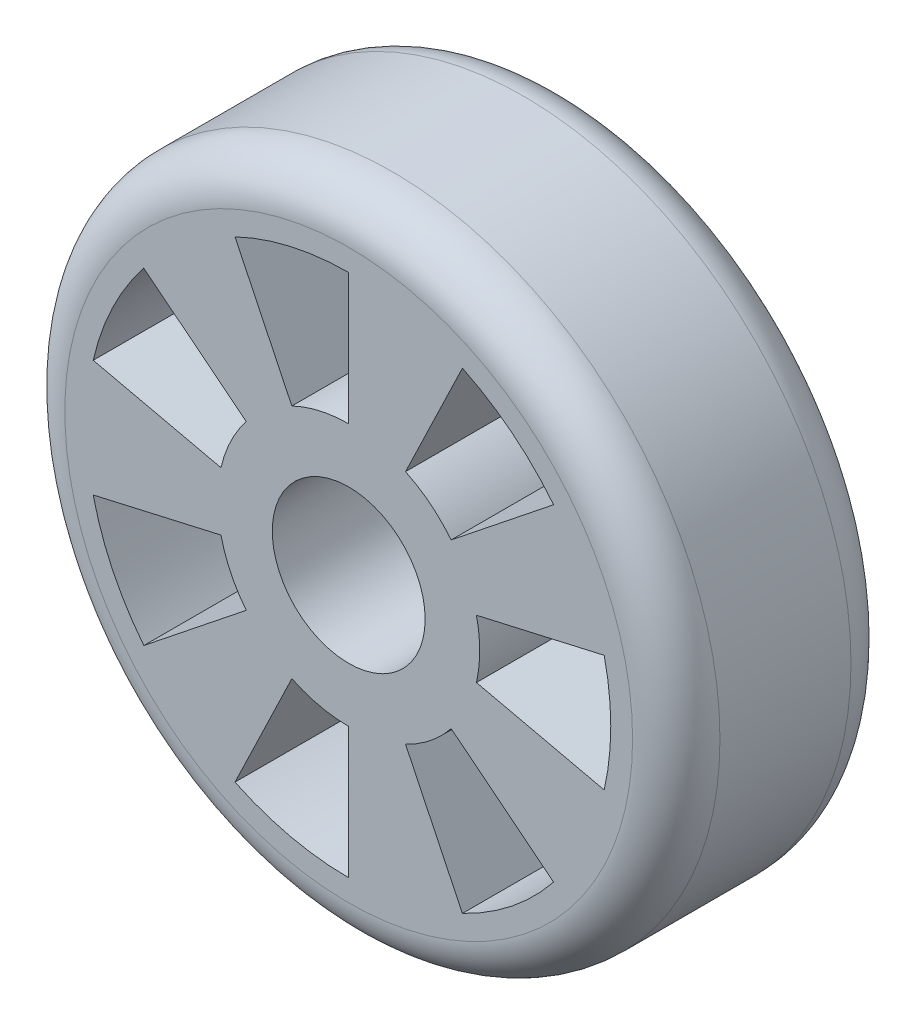
ISO-10303-21;
HEADER;
FILE_DESCRIPTION(('STEP AP214'),'2;1');
FILE_NAME('part.step','',(''),(''),'','','');
FILE_SCHEMA(('AUTOMOTIVE_DESIGN { 1 0 10303 214 1 1 1 1 }'));
ENDSEC;
DATA;
#1=APPLICATION_CONTEXT('core data for automotive mechanical design processes');
#2=APPLICATION_PROTOCOL_DEFINITION('international standard','automotive_design',2000,#1);
#3=PRODUCT_CONTEXT('',#1,'mechanical');
#4=PRODUCT('Part','Part','',(#3));
#5=PRODUCT_RELATED_PRODUCT_CATEGORY('part','',(#4));
#6=PRODUCT_DEFINITION_FORMATION('','',#4);
#7=PRODUCT_DEFINITION_CONTEXT('part definition',#1,'design');
#8=PRODUCT_DEFINITION('design','',#6,#7);
#9=PRODUCT_DEFINITION_SHAPE('','',#8);
#10=(LENGTH_UNIT() NAMED_UNIT(*) SI_UNIT(.MILLI.,.METRE.));
#11=(NAMED_UNIT(*) PLANE_ANGLE_UNIT() SI_UNIT($,.RADIAN.));
#12=(NAMED_UNIT(*) SI_UNIT($,.STERADIAN.) SOLID_ANGLE_UNIT());
#13=UNCERTAINTY_MEASURE_WITH_UNIT(LENGTH_MEASURE(1.E-05),#10,'distance_accuracy_value','');
#14=(GEOMETRIC_REPRESENTATION_CONTEXT(3) GLOBAL_UNCERTAINTY_ASSIGNED_CONTEXT((#13)) GLOBAL_UNIT_ASSIGNED_CONTEXT((#10,
#11,#12)) REPRESENTATION_CONTEXT('',''));
#15=CARTESIAN_POINT('',(0.,0.,0.));
#16=DIRECTION('',(0.,0.,1.));
#17=DIRECTION('',(1.,0.,0.));
#18=AXIS2_PLACEMENT_3D('',#15,#16,#17);
#19=CARTESIAN_POINT('',(0.,0.,-50.));
#20=DIRECTION('',(0.,0.,1.));
#21=DIRECTION('',(1.,0.,0.));
#22=AXIS2_PLACEMENT_3D('',#19,#20,#21);
#23=CYLINDRICAL_SURFACE('',#22,75.);
#24=CARTESIAN_POINT('',(0.,0.,-10.));
#25=DIRECTION('',(0.,0.,1.));
#26=DIRECTION('',(1.,0.,0.));
#27=AXIS2_PLACEMENT_3D('',#24,#25,#26);
#28=CIRCLE('',#27,75.);
#29=CARTESIAN_POINT('',(75.,0.,-10.));
#30=VERTEX_POINT('',#29);
#31=EDGE_CURVE('E47',#30,#30,#28,.F.);
#32=ORIENTED_EDGE('',*,*,#31,.T.);
#33=EDGE_LOOP('',(#32));
#34=FACE_BOUND('',#33,.T.);
#35=CARTESIAN_POINT('',(0.,0.,-40.));
#36=DIRECTION('',(0.,0.,1.));
#37=DIRECTION('',(1.,0.,0.));
#38=AXIS2_PLACEMENT_3D('',#35,#36,#37);
#39=CIRCLE('',#38,75.);
#40=CARTESIAN_POINT('',(75.,0.,-40.));
#41=VERTEX_POINT('',#40);
#42=EDGE_CURVE('E459',#41,#41,#39,.T.);
#43=ORIENTED_EDGE('',*,*,#42,.T.);
#44=EDGE_LOOP('',(#43));
#45=FACE_BOUND('',#44,.T.);
#46=ADVANCED_FACE('F39',(#34,#45),#23,.T.);
#47=CARTESIAN_POINT('',(0.,0.,-50.));
#48=DIRECTION('',(0.,0.,1.));
#49=DIRECTION('',(1.,0.,0.));
#50=AXIS2_PLACEMENT_3D('',#47,#48,#49);
#51=PLANE('',#50);
#52=CARTESIAN_POINT('',(0.,0.,-50.));
#53=DIRECTION('',(0.,0.,1.));
#54=DIRECTION('',(1.,0.,0.));
#55=AXIS2_PLACEMENT_3D('',#52,#53,#54);
#56=CIRCLE('',#55,17.5);
#57=CARTESIAN_POINT('',(17.5,0.,-50.));
#58=VERTEX_POINT('',#57);
#59=EDGE_CURVE('E255',#58,#58,#56,.T.);
#60=ORIENTED_EDGE('',*,*,#59,.T.);
#61=EDGE_LOOP('',(#60));
#62=FACE_BOUND('',#61,.T.);
#63=CARTESIAN_POINT('',(0.,0.,-50.));
#64=DIRECTION('',(0.,0.,1.));
#65=DIRECTION('',(1.,0.,0.));
#66=AXIS2_PLACEMENT_3D('',#63,#64,#65);
#67=CIRCLE('',#66,65.);
#68=CARTESIAN_POINT('',(65.,0.,-50.));
#69=VERTEX_POINT('',#68);
#70=EDGE_CURVE('E11',#69,#69,#67,.F.);
#71=ORIENTED_EDGE('',*,*,#70,.T.);
#72=EDGE_LOOP('',(#71));
#73=FACE_BOUND('',#72,.T.);
#74=DIRECTION('',(0.974927912181824,-0.222520933956314,0.));
#75=VECTOR('',#74,1.);
#76=CARTESIAN_POINT('',(-29.2478373654547,6.67562801868943,-50.));
#77=LINE('',#76,#75);
#78=CARTESIAN_POINT('',(-58.4956747309094,13.3512560373788,-50.));
#79=VERTEX_POINT('',#78);
#80=CARTESIAN_POINT('',(-29.2478373654547,6.67562801868943,-50.));
#81=VERTEX_POINT('',#80);
#82=EDGE_CURVE('E232',#79,#81,#77,.T.);
#83=ORIENTED_EDGE('',*,*,#82,.T.);
#84=CARTESIAN_POINT('',(0.,0.,-50.));
#85=DIRECTION('',(0.,0.,-1.));
#86=DIRECTION('',(1.,0.,0.));
#87=AXIS2_PLACEMENT_3D('',#84,#85,#86);
#88=CIRCLE('',#87,30.);
#89=CARTESIAN_POINT('',(-23.4549444740409,18.704694055762,-50.));
#90=VERTEX_POINT('',#89);
#91=EDGE_CURVE('E226',#81,#90,#88,.T.);
#92=ORIENTED_EDGE('',*,*,#91,.T.);
#93=DIRECTION('',(-0.78183148246803,0.623489801858733,0.));
#94=VECTOR('',#93,1.);
#95=CARTESIAN_POINT('',(-23.4549444740409,18.704694055762,-50.));
#96=LINE('',#95,#94);
#97=CARTESIAN_POINT('',(-46.9098889480818,37.409388111524,-50.));
#98=VERTEX_POINT('',#97);
#99=EDGE_CURVE('E235',#90,#98,#96,.T.);
#100=ORIENTED_EDGE('',*,*,#99,.T.);
#101=CARTESIAN_POINT('',(0.,0.,-50.));
#102=DIRECTION('',(0.,0.,1.));
#103=DIRECTION('',(1.,0.,0.));
#104=AXIS2_PLACEMENT_3D('',#101,#102,#103);
#105=CIRCLE('',#104,60.);
#106=EDGE_CURVE('E54',#98,#79,#105,.T.);
#107=ORIENTED_EDGE('',*,*,#106,.T.);
#108=EDGE_LOOP('',(#83,#92,#100,#107));
#109=FACE_BOUND('',#108,.T.);
#110=DIRECTION('',(0.78183148246803,0.623489801858734,0.));
#111=VECTOR('',#110,1.);
#112=CARTESIAN_POINT('',(-23.4549444740409,-18.704694055762,-50.));
#113=LINE('',#112,#111);
#114=CARTESIAN_POINT('',(-46.9098889480818,-37.409388111524,-50.));
#115=VERTEX_POINT('',#114);
#116=CARTESIAN_POINT('',(-23.4549444740409,-18.704694055762,-50.));
#117=VERTEX_POINT('',#116);
#118=EDGE_CURVE('E275',#115,#117,#113,.T.);
#119=ORIENTED_EDGE('',*,*,#118,.T.);
#120=CARTESIAN_POINT('',(0.,0.,-50.));
#121=DIRECTION('',(0.,0.,-1.));
#122=DIRECTION('',(1.,0.,0.));
#123=AXIS2_PLACEMENT_3D('',#120,#121,#122);
#124=CIRCLE('',#123,30.);
#125=CARTESIAN_POINT('',(-29.2478373654547,-6.67562801868943,-50.));
#126=VERTEX_POINT('',#125);
#127=EDGE_CURVE('E265',#117,#126,#124,.T.);
#128=ORIENTED_EDGE('',*,*,#127,.T.);
#129=DIRECTION('',(-0.974927912181824,-0.222520933956315,0.));
#130=VECTOR('',#129,1.);
#131=CARTESIAN_POINT('',(-29.2478373654547,-6.67562801868943,-50.));
#132=LINE('',#131,#130);
#133=CARTESIAN_POINT('',(-58.4956747309094,-13.3512560373789,-50.));
#134=VERTEX_POINT('',#133);
#135=EDGE_CURVE('E268',#126,#134,#132,.T.);
#136=ORIENTED_EDGE('',*,*,#135,.T.);
#137=CARTESIAN_POINT('',(0.,0.,-50.));
#138=DIRECTION('',(0.,0.,1.));
#139=DIRECTION('',(1.,0.,0.));
#140=AXIS2_PLACEMENT_3D('',#137,#138,#139);
#141=CIRCLE('',#140,60.);
#142=EDGE_CURVE('E272',#134,#115,#141,.T.);
#143=ORIENTED_EDGE('',*,*,#142,.T.);
#144=EDGE_LOOP('',(#119,#128,#136,#143));
#145=FACE_BOUND('',#144,.T.);
#146=DIRECTION('',(0.,1.,0.));
#147=VECTOR('',#146,1.);
#148=CARTESIAN_POINT('',(0.,-30.,-50.));
#149=LINE('',#148,#147);
#150=CARTESIAN_POINT('',(0.,-60.,-50.));
#151=VERTEX_POINT('',#150);
#152=CARTESIAN_POINT('',(0.,-30.,-50.));
#153=VERTEX_POINT('',#152);
#154=EDGE_CURVE('E307',#151,#153,#149,.T.);
#155=ORIENTED_EDGE('',*,*,#154,.T.);
#156=CARTESIAN_POINT('',(0.,0.,-50.));
#157=DIRECTION('',(0.,0.,-1.));
#158=DIRECTION('',(1.,0.,0.));
#159=AXIS2_PLACEMENT_3D('',#156,#157,#158);
#160=CIRCLE('',#159,30.);
#161=CARTESIAN_POINT('',(-13.0165121735267,-27.0290660370726,-50.));
#162=VERTEX_POINT('',#161);
#163=EDGE_CURVE('E297',#153,#162,#160,.T.);
#164=ORIENTED_EDGE('',*,*,#163,.T.);
#165=DIRECTION('',(-0.433883739117558,-0.900968867902419,0.));
#166=VECTOR('',#165,1.);
#167=CARTESIAN_POINT('',(-13.0165121735267,-27.0290660370726,-50.));
#168=LINE('',#167,#166);
#169=CARTESIAN_POINT('',(-26.0330243470535,-54.0581320741451,-50.));
#170=VERTEX_POINT('',#169);
#171=EDGE_CURVE('E300',#162,#170,#168,.T.);
#172=ORIENTED_EDGE('',*,*,#171,.T.);
#173=CARTESIAN_POINT('',(0.,0.,-50.));
#174=DIRECTION('',(0.,0.,1.));
#175=DIRECTION('',(1.,0.,0.));
#176=AXIS2_PLACEMENT_3D('',#173,#174,#175);
#177=CIRCLE('',#176,60.);
#178=EDGE_CURVE('E304',#170,#151,#177,.T.);
#179=ORIENTED_EDGE('',*,*,#178,.T.);
#180=EDGE_LOOP('',(#155,#164,#172,#179));
#181=FACE_BOUND('',#180,.T.);
#182=DIRECTION('',(-0.78183148246803,0.623489801858733,0.));
#183=VECTOR('',#182,1.);
#184=CARTESIAN_POINT('',(23.4549444740409,-18.704694055762,-50.));
#185=LINE('',#184,#183);
#186=CARTESIAN_POINT('',(46.9098889480818,-37.409388111524,-50.));
#187=VERTEX_POINT('',#186);
#188=CARTESIAN_POINT('',(23.4549444740409,-18.704694055762,-50.));
#189=VERTEX_POINT('',#188);
#190=EDGE_CURVE('E339',#187,#189,#185,.T.);
#191=ORIENTED_EDGE('',*,*,#190,.T.);
#192=CARTESIAN_POINT('',(0.,0.,-50.));
#193=DIRECTION('',(0.,0.,-1.));
#194=DIRECTION('',(1.,0.,0.));
#195=AXIS2_PLACEMENT_3D('',#192,#193,#194);
#196=CIRCLE('',#195,30.);
#197=CARTESIAN_POINT('',(13.0165121735267,-27.0290660370726,-50.));
#198=VERTEX_POINT('',#197);
#199=EDGE_CURVE('E329',#189,#198,#196,.T.);
#200=ORIENTED_EDGE('',*,*,#199,.T.);
#201=DIRECTION('',(0.433883739117559,-0.900968867902419,0.));
#202=VECTOR('',#201,1.);
#203=CARTESIAN_POINT('',(13.0165121735267,-27.0290660370726,-50.));
#204=LINE('',#203,#202);
#205=CARTESIAN_POINT('',(26.0330243470535,-54.0581320741451,-50.));
#206=VERTEX_POINT('',#205);
#207=EDGE_CURVE('E332',#198,#206,#204,.T.);
#208=ORIENTED_EDGE('',*,*,#207,.T.);
#209=CARTESIAN_POINT('',(0.,0.,-50.));
#210=DIRECTION('',(0.,0.,1.));
#211=DIRECTION('',(1.,0.,0.));
#212=AXIS2_PLACEMENT_3D('',#209,#210,#211);
#213=CIRCLE('',#212,60.);
#214=EDGE_CURVE('E336',#206,#187,#213,.T.);
#215=ORIENTED_EDGE('',*,*,#214,.T.);
#216=EDGE_LOOP('',(#191,#200,#208,#215));
#217=FACE_BOUND('',#216,.T.);
#218=DIRECTION('',(-0.974927912181824,-0.222520933956315,0.));
#219=VECTOR('',#218,1.);
#220=CARTESIAN_POINT('',(29.2478373654547,6.67562801868943,-50.));
#221=LINE('',#220,#219);
#222=CARTESIAN_POINT('',(58.4956747309094,13.3512560373789,-50.));
#223=VERTEX_POINT('',#222);
#224=CARTESIAN_POINT('',(29.2478373654547,6.67562801868943,-50.));
#225=VERTEX_POINT('',#224);
#226=EDGE_CURVE('E371',#223,#225,#221,.T.);
#227=ORIENTED_EDGE('',*,*,#226,.T.);
#228=CARTESIAN_POINT('',(0.,0.,-50.));
#229=DIRECTION('',(0.,0.,-1.));
#230=DIRECTION('',(1.,0.,0.));
#231=AXIS2_PLACEMENT_3D('',#228,#229,#230);
#232=CIRCLE('',#231,30.);
#233=CARTESIAN_POINT('',(29.2478373654547,-6.67562801868943,-50.));
#234=VERTEX_POINT('',#233);
#235=EDGE_CURVE('E361',#225,#234,#232,.T.);
#236=ORIENTED_EDGE('',*,*,#235,.T.);
#237=DIRECTION('',(0.974927912181824,-0.222520933956314,0.));
#238=VECTOR('',#237,1.);
#239=CARTESIAN_POINT('',(29.2478373654547,-6.67562801868943,-50.));
#240=LINE('',#239,#238);
#241=CARTESIAN_POINT('',(58.4956747309094,-13.3512560373788,-50.));
#242=VERTEX_POINT('',#241);
#243=EDGE_CURVE('E364',#234,#242,#240,.T.);
#244=ORIENTED_EDGE('',*,*,#243,.T.);
#245=CARTESIAN_POINT('',(0.,0.,-50.));
#246=DIRECTION('',(0.,0.,1.));
#247=DIRECTION('',(1.,0.,0.));
#248=AXIS2_PLACEMENT_3D('',#245,#246,#247);
#249=CIRCLE('',#248,60.);
#250=EDGE_CURVE('E368',#242,#223,#249,.T.);
#251=ORIENTED_EDGE('',*,*,#250,.T.);
#252=EDGE_LOOP('',(#227,#236,#244,#251));
#253=FACE_BOUND('',#252,.T.);
#254=DIRECTION('',(-0.433883739117558,-0.900968867902419,0.));
#255=VECTOR('',#254,1.);
#256=CARTESIAN_POINT('',(13.0165121735267,27.0290660370726,-50.));
#257=LINE('',#256,#255);
#258=CARTESIAN_POINT('',(26.0330243470535,54.0581320741451,-50.));
#259=VERTEX_POINT('',#258);
#260=CARTESIAN_POINT('',(13.0165121735267,27.0290660370726,-50.));
#261=VERTEX_POINT('',#260);
#262=EDGE_CURVE('E403',#259,#261,#257,.T.);
#263=ORIENTED_EDGE('',*,*,#262,.T.);
#264=CARTESIAN_POINT('',(0.,0.,-50.));
#265=DIRECTION('',(0.,0.,-1.));
#266=DIRECTION('',(1.,0.,0.));
#267=AXIS2_PLACEMENT_3D('',#264,#265,#266);
#268=CIRCLE('',#267,30.);
#269=CARTESIAN_POINT('',(23.4549444740409,18.704694055762,-50.));
#270=VERTEX_POINT('',#269);
#271=EDGE_CURVE('E393',#261,#270,#268,.T.);
#272=ORIENTED_EDGE('',*,*,#271,.T.);
#273=DIRECTION('',(0.781831482468029,0.623489801858734,0.));
#274=VECTOR('',#273,1.);
#275=CARTESIAN_POINT('',(23.4549444740409,18.704694055762,-50.));
#276=LINE('',#275,#274);
#277=CARTESIAN_POINT('',(46.9098889480818,37.409388111524,-50.));
#278=VERTEX_POINT('',#277);
#279=EDGE_CURVE('E396',#270,#278,#276,.T.);
#280=ORIENTED_EDGE('',*,*,#279,.T.);
#281=CARTESIAN_POINT('',(0.,0.,-50.));
#282=DIRECTION('',(0.,0.,1.));
#283=DIRECTION('',(1.,0.,0.));
#284=AXIS2_PLACEMENT_3D('',#281,#282,#283);
#285=CIRCLE('',#284,60.);
#286=EDGE_CURVE('E400',#278,#259,#285,.T.);
#287=ORIENTED_EDGE('',*,*,#286,.T.);
#288=EDGE_LOOP('',(#263,#272,#280,#287));
#289=FACE_BOUND('',#288,.T.);
#290=DIRECTION('',(0.433883739117558,-0.900968867902419,0.));
#291=VECTOR('',#290,1.);
#292=CARTESIAN_POINT('',(-13.0165121735267,27.0290660370726,-50.));
#293=LINE('',#292,#291);
#294=CARTESIAN_POINT('',(-26.0330243470535,54.0581320741451,-50.));
#295=VERTEX_POINT('',#294);
#296=CARTESIAN_POINT('',(-13.0165121735267,27.0290660370726,-50.));
#297=VERTEX_POINT('',#296);
#298=EDGE_CURVE('E435',#295,#297,#293,.T.);
#299=ORIENTED_EDGE('',*,*,#298,.T.);
#300=CARTESIAN_POINT('',(0.,0.,-50.));
#301=DIRECTION('',(0.,0.,-1.));
#302=DIRECTION('',(1.,0.,0.));
#303=AXIS2_PLACEMENT_3D('',#300,#301,#302);
#304=CIRCLE('',#303,30.);
#305=CARTESIAN_POINT('',(0.,30.,-50.));
#306=VERTEX_POINT('',#305);
#307=EDGE_CURVE('E425',#297,#306,#304,.T.);
#308=ORIENTED_EDGE('',*,*,#307,.T.);
#309=DIRECTION('',(0.,1.,0.));
#310=VECTOR('',#309,1.);
#311=CARTESIAN_POINT('',(0.,30.,-50.));
#312=LINE('',#311,#310);
#313=CARTESIAN_POINT('',(0.,60.,-50.));
#314=VERTEX_POINT('',#313);
#315=EDGE_CURVE('E428',#306,#314,#312,.T.);
#316=ORIENTED_EDGE('',*,*,#315,.T.);
#317=CARTESIAN_POINT('',(0.,0.,-50.));
#318=DIRECTION('',(0.,0.,1.));
#319=DIRECTION('',(1.,0.,0.));
#320=AXIS2_PLACEMENT_3D('',#317,#318,#319);
#321=CIRCLE('',#320,60.);
#322=EDGE_CURVE('E432',#314,#295,#321,.T.);
#323=ORIENTED_EDGE('',*,*,#322,.T.);
#324=EDGE_LOOP('',(#299,#308,#316,#323));
#325=FACE_BOUND('',#324,.T.);
#326=ADVANCED_FACE('F239',(#62,#73,#109,#145,#181,#217,#253,#289,#325),#51,.F.);
#327=CARTESIAN_POINT('',(0.,0.,0.));
#328=DIRECTION('',(0.,0.,1.));
#329=DIRECTION('',(1.,0.,0.));
#330=AXIS2_PLACEMENT_3D('',#327,#328,#329);
#331=PLANE('',#330);
#332=CARTESIAN_POINT('',(0.,0.,0.));
#333=DIRECTION('',(0.,0.,1.));
#334=DIRECTION('',(1.,0.,0.));
#335=AXIS2_PLACEMENT_3D('',#332,#333,#334);
#336=CIRCLE('',#335,17.5);
#337=CARTESIAN_POINT('',(17.5,0.,0.));
#338=VERTEX_POINT('',#337);
#339=EDGE_CURVE('E248',#338,#338,#336,.T.);
#340=ORIENTED_EDGE('',*,*,#339,.F.);
#341=EDGE_LOOP('',(#340));
#342=FACE_BOUND('',#341,.T.);
#343=CARTESIAN_POINT('',(0.,0.,0.));
#344=DIRECTION('',(0.,0.,1.));
#345=DIRECTION('',(1.,0.,0.));
#346=AXIS2_PLACEMENT_3D('',#343,#344,#345);
#347=CIRCLE('',#346,65.);
#348=CARTESIAN_POINT('',(65.,0.,0.));
#349=VERTEX_POINT('',#348);
#350=EDGE_CURVE('E450',#349,#349,#347,.T.);
#351=ORIENTED_EDGE('',*,*,#350,.T.);
#352=EDGE_LOOP('',(#351));
#353=FACE_BOUND('',#352,.T.);
#354=CARTESIAN_POINT('',(0.,0.,0.));
#355=DIRECTION('',(0.,0.,-1.));
#356=DIRECTION('',(1.,0.,0.));
#357=AXIS2_PLACEMENT_3D('',#354,#355,#356);
#358=CIRCLE('',#357,30.);
#359=CARTESIAN_POINT('',(-29.2478373654547,6.67562801868943,0.));
#360=VERTEX_POINT('',#359);
#361=CARTESIAN_POINT('',(-23.4549444740409,18.704694055762,0.));
#362=VERTEX_POINT('',#361);
#363=EDGE_CURVE('E62',#360,#362,#358,.T.);
#364=ORIENTED_EDGE('',*,*,#363,.F.);
#365=DIRECTION('',(0.974927912181824,-0.222520933956314,0.));
#366=VECTOR('',#365,1.);
#367=CARTESIAN_POINT('',(-29.2478373654547,6.67562801868943,0.));
#368=LINE('',#367,#366);
#369=CARTESIAN_POINT('',(-58.4956747309094,13.3512560373788,0.));
#370=VERTEX_POINT('',#369);
#371=EDGE_CURVE('E242',#370,#360,#368,.T.);
#372=ORIENTED_EDGE('',*,*,#371,.F.);
#373=CARTESIAN_POINT('',(0.,0.,0.));
#374=DIRECTION('',(0.,0.,1.));
#375=DIRECTION('',(1.,0.,0.));
#376=AXIS2_PLACEMENT_3D('',#373,#374,#375);
#377=CIRCLE('',#376,60.);
#378=CARTESIAN_POINT('',(-46.9098889480818,37.409388111524,0.));
#379=VERTEX_POINT('',#378);
#380=EDGE_CURVE('E245',#379,#370,#377,.T.);
#381=ORIENTED_EDGE('',*,*,#380,.F.);
#382=DIRECTION('',(-0.78183148246803,0.623489801858733,0.));
#383=VECTOR('',#382,1.);
#384=CARTESIAN_POINT('',(-23.4549444740409,18.704694055762,0.));
#385=LINE('',#384,#383);
#386=EDGE_CURVE('E254',#362,#379,#385,.T.);
#387=ORIENTED_EDGE('',*,*,#386,.F.);
#388=EDGE_LOOP('',(#364,#372,#381,#387));
#389=FACE_BOUND('',#388,.T.);
#390=CARTESIAN_POINT('',(0.,0.,0.));
#391=DIRECTION('',(0.,0.,-1.));
#392=DIRECTION('',(1.,0.,0.));
#393=AXIS2_PLACEMENT_3D('',#390,#391,#392);
#394=CIRCLE('',#393,30.);
#395=CARTESIAN_POINT('',(-23.4549444740409,-18.704694055762,0.));
#396=VERTEX_POINT('',#395);
#397=CARTESIAN_POINT('',(-29.2478373654547,-6.67562801868943,0.));
#398=VERTEX_POINT('',#397);
#399=EDGE_CURVE('E261',#396,#398,#394,.T.);
#400=ORIENTED_EDGE('',*,*,#399,.F.);
#401=DIRECTION('',(0.78183148246803,0.623489801858734,0.));
#402=VECTOR('',#401,1.);
#403=CARTESIAN_POINT('',(-23.4549444740409,-18.704694055762,0.));
#404=LINE('',#403,#402);
#405=CARTESIAN_POINT('',(-46.9098889480818,-37.409388111524,0.));
#406=VERTEX_POINT('',#405);
#407=EDGE_CURVE('E269',#406,#396,#404,.T.);
#408=ORIENTED_EDGE('',*,*,#407,.F.);
#409=CARTESIAN_POINT('',(0.,0.,0.));
#410=DIRECTION('',(0.,0.,1.));
#411=DIRECTION('',(1.,0.,0.));
#412=AXIS2_PLACEMENT_3D('',#409,#410,#411);
#413=CIRCLE('',#412,60.);
#414=CARTESIAN_POINT('',(-58.4956747309094,-13.3512560373789,0.));
#415=VERTEX_POINT('',#414);
#416=EDGE_CURVE('E283',#415,#406,#413,.T.);
#417=ORIENTED_EDGE('',*,*,#416,.F.);
#418=DIRECTION('',(-0.974927912181824,-0.222520933956315,0.));
#419=VECTOR('',#418,1.);
#420=CARTESIAN_POINT('',(-29.2478373654547,-6.67562801868943,0.));
#421=LINE('',#420,#419);
#422=EDGE_CURVE('E280',#398,#415,#421,.T.);
#423=ORIENTED_EDGE('',*,*,#422,.F.);
#424=EDGE_LOOP('',(#400,#408,#417,#423));
#425=FACE_BOUND('',#424,.T.);
#426=CARTESIAN_POINT('',(0.,0.,0.));
#427=DIRECTION('',(0.,0.,-1.));
#428=DIRECTION('',(1.,0.,0.));
#429=AXIS2_PLACEMENT_3D('',#426,#427,#428);
#430=CIRCLE('',#429,30.);
#431=CARTESIAN_POINT('',(0.,-30.,0.));
#432=VERTEX_POINT('',#431);
#433=CARTESIAN_POINT('',(-13.0165121735267,-27.0290660370726,0.));
#434=VERTEX_POINT('',#433);
#435=EDGE_CURVE('E290',#432,#434,#430,.T.);
#436=ORIENTED_EDGE('',*,*,#435,.F.);
#437=DIRECTION('',(0.,1.,0.));
#438=VECTOR('',#437,1.);
#439=CARTESIAN_POINT('',(0.,-30.,0.));
#440=LINE('',#439,#438);
#441=CARTESIAN_POINT('',(0.,-60.,0.));
#442=VERTEX_POINT('',#441);
#443=EDGE_CURVE('E301',#442,#432,#440,.T.);
#444=ORIENTED_EDGE('',*,*,#443,.F.);
#445=CARTESIAN_POINT('',(0.,0.,0.));
#446=DIRECTION('',(0.,0.,1.));
#447=DIRECTION('',(1.,0.,0.));
#448=AXIS2_PLACEMENT_3D('',#445,#446,#447);
#449=CIRCLE('',#448,60.);
#450=CARTESIAN_POINT('',(-26.0330243470535,-54.0581320741451,0.));
#451=VERTEX_POINT('',#450);
#452=EDGE_CURVE('E315',#451,#442,#449,.T.);
#453=ORIENTED_EDGE('',*,*,#452,.F.);
#454=DIRECTION('',(-0.433883739117558,-0.900968867902419,0.));
#455=VECTOR('',#454,1.);
#456=CARTESIAN_POINT('',(-13.0165121735267,-27.0290660370726,0.));
#457=LINE('',#456,#455);
#458=EDGE_CURVE('E312',#434,#451,#457,.T.);
#459=ORIENTED_EDGE('',*,*,#458,.F.);
#460=EDGE_LOOP('',(#436,#444,#453,#459));
#461=FACE_BOUND('',#460,.T.);
#462=CARTESIAN_POINT('',(0.,0.,0.));
#463=DIRECTION('',(0.,0.,-1.));
#464=DIRECTION('',(1.,0.,0.));
#465=AXIS2_PLACEMENT_3D('',#462,#463,#464);
#466=CIRCLE('',#465,30.);
#467=CARTESIAN_POINT('',(23.4549444740409,-18.704694055762,0.));
#468=VERTEX_POINT('',#467);
#469=CARTESIAN_POINT('',(13.0165121735267,-27.0290660370726,0.));
#470=VERTEX_POINT('',#469);
#471=EDGE_CURVE('E322',#468,#470,#466,.T.);
#472=ORIENTED_EDGE('',*,*,#471,.F.);
#473=DIRECTION('',(-0.78183148246803,0.623489801858733,0.));
#474=VECTOR('',#473,1.);
#475=CARTESIAN_POINT('',(23.4549444740409,-18.704694055762,0.));
#476=LINE('',#475,#474);
#477=CARTESIAN_POINT('',(46.9098889480818,-37.409388111524,0.));
#478=VERTEX_POINT('',#477);
#479=EDGE_CURVE('E333',#478,#468,#476,.T.);
#480=ORIENTED_EDGE('',*,*,#479,.F.);
#481=CARTESIAN_POINT('',(0.,0.,0.));
#482=DIRECTION('',(0.,0.,1.));
#483=DIRECTION('',(1.,0.,0.));
#484=AXIS2_PLACEMENT_3D('',#481,#482,#483);
#485=CIRCLE('',#484,60.);
#486=CARTESIAN_POINT('',(26.0330243470535,-54.0581320741451,0.));
#487=VERTEX_POINT('',#486);
#488=EDGE_CURVE('E347',#487,#478,#485,.T.);
#489=ORIENTED_EDGE('',*,*,#488,.F.);
#490=DIRECTION('',(0.433883739117559,-0.900968867902419,0.));
#491=VECTOR('',#490,1.);
#492=CARTESIAN_POINT('',(13.0165121735267,-27.0290660370726,0.));
#493=LINE('',#492,#491);
#494=EDGE_CURVE('E344',#470,#487,#493,.T.);
#495=ORIENTED_EDGE('',*,*,#494,.F.);
#496=EDGE_LOOP('',(#472,#480,#489,#495));
#497=FACE_BOUND('',#496,.T.);
#498=CARTESIAN_POINT('',(0.,0.,0.));
#499=DIRECTION('',(0.,0.,-1.));
#500=DIRECTION('',(1.,0.,0.));
#501=AXIS2_PLACEMENT_3D('',#498,#499,#500);
#502=CIRCLE('',#501,30.);
#503=CARTESIAN_POINT('',(29.2478373654547,6.67562801868943,0.));
#504=VERTEX_POINT('',#503);
#505=CARTESIAN_POINT('',(29.2478373654547,-6.67562801868943,0.));
#506=VERTEX_POINT('',#505);
#507=EDGE_CURVE('E354',#504,#506,#502,.T.);
#508=ORIENTED_EDGE('',*,*,#507,.F.);
#509=DIRECTION('',(-0.974927912181824,-0.222520933956315,0.));
#510=VECTOR('',#509,1.);
#511=CARTESIAN_POINT('',(29.2478373654547,6.67562801868943,0.));
#512=LINE('',#511,#510);
#513=CARTESIAN_POINT('',(58.4956747309094,13.3512560373789,0.));
#514=VERTEX_POINT('',#513);
#515=EDGE_CURVE('E365',#514,#504,#512,.T.);
#516=ORIENTED_EDGE('',*,*,#515,.F.);
#517=CARTESIAN_POINT('',(0.,0.,0.));
#518=DIRECTION('',(0.,0.,1.));
#519=DIRECTION('',(1.,0.,0.));
#520=AXIS2_PLACEMENT_3D('',#517,#518,#519);
#521=CIRCLE('',#520,60.);
#522=CARTESIAN_POINT('',(58.4956747309094,-13.3512560373789,0.));
#523=VERTEX_POINT('',#522);
#524=EDGE_CURVE('E379',#523,#514,#521,.T.);
#525=ORIENTED_EDGE('',*,*,#524,.F.);
#526=DIRECTION('',(0.974927912181824,-0.222520933956314,0.));
#527=VECTOR('',#526,1.);
#528=CARTESIAN_POINT('',(29.2478373654547,-6.67562801868943,0.));
#529=LINE('',#528,#527);
#530=EDGE_CURVE('E376',#506,#523,#529,.T.);
#531=ORIENTED_EDGE('',*,*,#530,.F.);
#532=EDGE_LOOP('',(#508,#516,#525,#531));
#533=FACE_BOUND('',#532,.T.);
#534=CARTESIAN_POINT('',(0.,0.,0.));
#535=DIRECTION('',(0.,0.,-1.));
#536=DIRECTION('',(1.,0.,0.));
#537=AXIS2_PLACEMENT_3D('',#534,#535,#536);
#538=CIRCLE('',#537,30.);
#539=CARTESIAN_POINT('',(13.0165121735267,27.0290660370726,0.));
#540=VERTEX_POINT('',#539);
#541=CARTESIAN_POINT('',(23.4549444740409,18.704694055762,0.));
#542=VERTEX_POINT('',#541);
#543=EDGE_CURVE('E386',#540,#542,#538,.T.);
#544=ORIENTED_EDGE('',*,*,#543,.F.);
#545=DIRECTION('',(-0.433883739117558,-0.900968867902419,0.));
#546=VECTOR('',#545,1.);
#547=CARTESIAN_POINT('',(13.0165121735267,27.0290660370726,0.));
#548=LINE('',#547,#546);
#549=CARTESIAN_POINT('',(26.0330243470535,54.0581320741451,0.));
#550=VERTEX_POINT('',#549);
#551=EDGE_CURVE('E397',#550,#540,#548,.T.);
#552=ORIENTED_EDGE('',*,*,#551,.F.);
#553=CARTESIAN_POINT('',(0.,0.,0.));
#554=DIRECTION('',(0.,0.,1.));
#555=DIRECTION('',(1.,0.,0.));
#556=AXIS2_PLACEMENT_3D('',#553,#554,#555);
#557=CIRCLE('',#556,60.);
#558=CARTESIAN_POINT('',(46.9098889480818,37.409388111524,0.));
#559=VERTEX_POINT('',#558);
#560=EDGE_CURVE('E411',#559,#550,#557,.T.);
#561=ORIENTED_EDGE('',*,*,#560,.F.);
#562=DIRECTION('',(0.781831482468029,0.623489801858734,0.));
#563=VECTOR('',#562,1.);
#564=CARTESIAN_POINT('',(23.4549444740409,18.704694055762,0.));
#565=LINE('',#564,#563);
#566=EDGE_CURVE('E408',#542,#559,#565,.T.);
#567=ORIENTED_EDGE('',*,*,#566,.F.);
#568=EDGE_LOOP('',(#544,#552,#561,#567));
#569=FACE_BOUND('',#568,.T.);
#570=CARTESIAN_POINT('',(0.,0.,0.));
#571=DIRECTION('',(0.,0.,-1.));
#572=DIRECTION('',(1.,0.,0.));
#573=AXIS2_PLACEMENT_3D('',#570,#571,#572);
#574=CIRCLE('',#573,30.);
#575=CARTESIAN_POINT('',(-13.0165121735267,27.0290660370726,0.));
#576=VERTEX_POINT('',#575);
#577=CARTESIAN_POINT('',(0.,30.,0.));
#578=VERTEX_POINT('',#577);
#579=EDGE_CURVE('E418',#576,#578,#574,.T.);
#580=ORIENTED_EDGE('',*,*,#579,.F.);
#581=DIRECTION('',(0.433883739117558,-0.900968867902419,0.));
#582=VECTOR('',#581,1.);
#583=CARTESIAN_POINT('',(-13.0165121735267,27.0290660370726,0.));
#584=LINE('',#583,#582);
#585=CARTESIAN_POINT('',(-26.0330243470535,54.0581320741451,0.));
#586=VERTEX_POINT('',#585);
#587=EDGE_CURVE('E429',#586,#576,#584,.T.);
#588=ORIENTED_EDGE('',*,*,#587,.F.);
#589=CARTESIAN_POINT('',(0.,0.,0.));
#590=DIRECTION('',(0.,0.,1.));
#591=DIRECTION('',(1.,0.,0.));
#592=AXIS2_PLACEMENT_3D('',#589,#590,#591);
#593=CIRCLE('',#592,60.);
#594=CARTESIAN_POINT('',(0.,60.,0.));
#595=VERTEX_POINT('',#594);
#596=EDGE_CURVE('E443',#595,#586,#593,.T.);
#597=ORIENTED_EDGE('',*,*,#596,.F.);
#598=DIRECTION('',(0.,1.,0.));
#599=VECTOR('',#598,1.);
#600=CARTESIAN_POINT('',(0.,30.,0.));
#601=LINE('',#600,#599);
#602=EDGE_CURVE('E440',#578,#595,#601,.T.);
#603=ORIENTED_EDGE('',*,*,#602,.F.);
#604=EDGE_LOOP('',(#580,#588,#597,#603));
#605=FACE_BOUND('',#604,.T.);
#606=ADVANCED_FACE('F471',(#342,#353,#389,#425,#461,#497,#533,#569,#605),#331,.T.);
#607=CARTESIAN_POINT('',(0.,0.,-50.));
#608=DIRECTION('',(0.,0.,1.));
#609=DIRECTION('',(1.,0.,0.));
#610=AXIS2_PLACEMENT_3D('',#607,#608,#609);
#611=CYLINDRICAL_SURFACE('',#610,30.);
#612=ORIENTED_EDGE('',*,*,#579,.T.);
#613=DIRECTION('',(0.,0.,1.));
#614=VECTOR('',#613,1.);
#615=CARTESIAN_POINT('',(0.,30.,-50.));
#616=LINE('',#615,#614);
#617=EDGE_CURVE('E438',#306,#578,#616,.T.);
#618=ORIENTED_EDGE('',*,*,#617,.F.);
#619=ORIENTED_EDGE('',*,*,#307,.F.);
#620=DIRECTION('',(0.,0.,1.));
#621=VECTOR('',#620,1.);
#622=CARTESIAN_POINT('',(-13.0165121735267,27.0290660370726,-50.));
#623=LINE('',#622,#621);
#624=EDGE_CURVE('E448',#297,#576,#623,.T.);
#625=ORIENTED_EDGE('',*,*,#624,.T.);
#626=EDGE_LOOP('',(#612,#618,#619,#625));
#627=FACE_BOUND('',#626,.T.);
#628=ADVANCED_FACE('F474',(#627),#611,.T.);
#629=CARTESIAN_POINT('',(-13.0165121735267,27.0290660370726,-50.));
#630=DIRECTION('',(-0.900968867902419,-0.433883739117558,0.));
#631=DIRECTION('',(0.433883739117558,-0.900968867902419,0.));
#632=AXIS2_PLACEMENT_3D('',#629,#630,#631);
#633=PLANE('',#632);
#634=ORIENTED_EDGE('',*,*,#587,.T.);
#635=ORIENTED_EDGE('',*,*,#624,.F.);
#636=ORIENTED_EDGE('',*,*,#298,.F.);
#637=DIRECTION('',(0.,0.,1.));
#638=VECTOR('',#637,1.);
#639=CARTESIAN_POINT('',(-26.0330243470535,54.0581320741451,-50.));
#640=LINE('',#639,#638);
#641=EDGE_CURVE('E451',#295,#586,#640,.T.);
#642=ORIENTED_EDGE('',*,*,#641,.T.);
#643=EDGE_LOOP('',(#634,#635,#636,#642));
#644=FACE_BOUND('',#643,.T.);
#645=ADVANCED_FACE('F512',(#644),#633,.F.);
#646=CARTESIAN_POINT('',(0.,0.,-50.));
#647=DIRECTION('',(0.,0.,1.));
#648=DIRECTION('',(1.,0.,0.));
#649=AXIS2_PLACEMENT_3D('',#646,#647,#648);
#650=CYLINDRICAL_SURFACE('',#649,60.);
#651=ORIENTED_EDGE('',*,*,#596,.T.);
#652=ORIENTED_EDGE('',*,*,#641,.F.);
#653=ORIENTED_EDGE('',*,*,#322,.F.);
#654=DIRECTION('',(0.,0.,1.));
#655=VECTOR('',#654,1.);
#656=CARTESIAN_POINT('',(0.,60.,-50.));
#657=LINE('',#656,#655);
#658=EDGE_CURVE('E453',#314,#595,#657,.T.);
#659=ORIENTED_EDGE('',*,*,#658,.T.);
#660=EDGE_LOOP('',(#651,#652,#653,#659));
#661=FACE_BOUND('',#660,.T.);
#662=ADVANCED_FACE('F514',(#661),#650,.F.);
#663=CARTESIAN_POINT('',(0.,30.,-50.));
#664=DIRECTION('',(1.,0.,0.));
#665=DIRECTION('',(0.,1.,0.));
#666=AXIS2_PLACEMENT_3D('',#663,#664,#665);
#667=PLANE('',#666);
#668=ORIENTED_EDGE('',*,*,#602,.T.);
#669=ORIENTED_EDGE('',*,*,#658,.F.);
#670=ORIENTED_EDGE('',*,*,#315,.F.);
#671=ORIENTED_EDGE('',*,*,#617,.T.);
#672=EDGE_LOOP('',(#668,#669,#670,#671));
#673=FACE_BOUND('',#672,.T.);
#674=ADVANCED_FACE('F507',(#673),#667,.F.);
#675=CARTESIAN_POINT('',(0.,0.,-50.));
#676=DIRECTION('',(0.,0.,1.));
#677=DIRECTION('',(1.,0.,0.));
#678=AXIS2_PLACEMENT_3D('',#675,#676,#677);
#679=CYLINDRICAL_SURFACE('',#678,30.);
#680=ORIENTED_EDGE('',*,*,#543,.T.);
#681=DIRECTION('',(0.,0.,1.));
#682=VECTOR('',#681,1.);
#683=CARTESIAN_POINT('',(23.4549444740409,18.704694055762,-50.));
#684=LINE('',#683,#682);
#685=EDGE_CURVE('E406',#270,#542,#684,.T.);
#686=ORIENTED_EDGE('',*,*,#685,.F.);
#687=ORIENTED_EDGE('',*,*,#271,.F.);
#688=DIRECTION('',(0.,0.,1.));
#689=VECTOR('',#688,1.);
#690=CARTESIAN_POINT('',(13.0165121735267,27.0290660370726,-50.));
#691=LINE('',#690,#689);
#692=EDGE_CURVE('E416',#261,#540,#691,.T.);
#693=ORIENTED_EDGE('',*,*,#692,.T.);
#694=EDGE_LOOP('',(#680,#686,#687,#693));
#695=FACE_BOUND('',#694,.T.);
#696=ADVANCED_FACE('F521',(#695),#679,.T.);
#697=CARTESIAN_POINT('',(13.0165121735267,27.0290660370726,-50.));
#698=DIRECTION('',(-0.900968867902419,0.433883739117558,0.));
#699=DIRECTION('',(-0.433883739117558,-0.900968867902419,0.));
#700=AXIS2_PLACEMENT_3D('',#697,#698,#699);
#701=PLANE('',#700);
#702=ORIENTED_EDGE('',*,*,#551,.T.);
#703=ORIENTED_EDGE('',*,*,#692,.F.);
#704=ORIENTED_EDGE('',*,*,#262,.F.);
#705=DIRECTION('',(0.,0.,1.));
#706=VECTOR('',#705,1.);
#707=CARTESIAN_POINT('',(26.0330243470535,54.0581320741451,-50.));
#708=LINE('',#707,#706);
#709=EDGE_CURVE('E419',#259,#550,#708,.T.);
#710=ORIENTED_EDGE('',*,*,#709,.T.);
#711=EDGE_LOOP('',(#702,#703,#704,#710));
#712=FACE_BOUND('',#711,.T.);
#713=ADVANCED_FACE('F560',(#712),#701,.F.);
#714=CARTESIAN_POINT('',(0.,0.,-50.));
#715=DIRECTION('',(0.,0.,1.));
#716=DIRECTION('',(1.,0.,0.));
#717=AXIS2_PLACEMENT_3D('',#714,#715,#716);
#718=CYLINDRICAL_SURFACE('',#717,60.);
#719=ORIENTED_EDGE('',*,*,#560,.T.);
#720=ORIENTED_EDGE('',*,*,#709,.F.);
#721=ORIENTED_EDGE('',*,*,#286,.F.);
#722=DIRECTION('',(0.,0.,1.));
#723=VECTOR('',#722,1.);
#724=CARTESIAN_POINT('',(46.9098889480818,37.409388111524,-50.));
#725=LINE('',#724,#723);
#726=EDGE_CURVE('E421',#278,#559,#725,.T.);
#727=ORIENTED_EDGE('',*,*,#726,.T.);
#728=EDGE_LOOP('',(#719,#720,#721,#727));
#729=FACE_BOUND('',#728,.T.);
#730=ADVANCED_FACE('F570',(#729),#718,.F.);
#731=CARTESIAN_POINT('',(23.4549444740409,18.704694055762,-50.));
#732=DIRECTION('',(0.623489801858734,-0.781831482468029,0.));
#733=DIRECTION('',(0.78183148246803,0.623489801858734,0.));
#734=AXIS2_PLACEMENT_3D('',#731,#732,#733);
#735=PLANE('',#734);
#736=ORIENTED_EDGE('',*,*,#566,.T.);
#737=ORIENTED_EDGE('',*,*,#726,.F.);
#738=ORIENTED_EDGE('',*,*,#279,.F.);
#739=ORIENTED_EDGE('',*,*,#685,.T.);
#740=EDGE_LOOP('',(#736,#737,#738,#739));
#741=FACE_BOUND('',#740,.T.);
#742=ADVANCED_FACE('F580',(#741),#735,.F.);
#743=CARTESIAN_POINT('',(0.,0.,-50.));
#744=DIRECTION('',(0.,0.,1.));
#745=DIRECTION('',(1.,0.,0.));
#746=AXIS2_PLACEMENT_3D('',#743,#744,#745);
#747=CYLINDRICAL_SURFACE('',#746,30.);
#748=ORIENTED_EDGE('',*,*,#507,.T.);
#749=DIRECTION('',(0.,0.,1.));
#750=VECTOR('',#749,1.);
#751=CARTESIAN_POINT('',(29.2478373654547,-6.67562801868943,-50.));
#752=LINE('',#751,#750);
#753=EDGE_CURVE('E374',#234,#506,#752,.T.);
#754=ORIENTED_EDGE('',*,*,#753,.F.);
#755=ORIENTED_EDGE('',*,*,#235,.F.);
#756=DIRECTION('',(0.,0.,1.));
#757=VECTOR('',#756,1.);
#758=CARTESIAN_POINT('',(29.2478373654547,6.67562801868943,-50.));
#759=LINE('',#758,#757);
#760=EDGE_CURVE('E384',#225,#504,#759,.T.);
#761=ORIENTED_EDGE('',*,*,#760,.T.);
#762=EDGE_LOOP('',(#748,#754,#755,#761));
#763=FACE_BOUND('',#762,.T.);
#764=ADVANCED_FACE('F590',(#763),#747,.T.);
#765=CARTESIAN_POINT('',(29.2478373654547,6.67562801868943,-50.));
#766=DIRECTION('',(-0.222520933956315,0.974927912181824,0.));
#767=DIRECTION('',(-0.974927912181824,-0.222520933956315,0.));
#768=AXIS2_PLACEMENT_3D('',#765,#766,#767);
#769=PLANE('',#768);
#770=ORIENTED_EDGE('',*,*,#515,.T.);
#771=ORIENTED_EDGE('',*,*,#760,.F.);
#772=ORIENTED_EDGE('',*,*,#226,.F.);
#773=DIRECTION('',(0.,0.,1.));
#774=VECTOR('',#773,1.);
#775=CARTESIAN_POINT('',(58.4956747309094,13.3512560373789,-50.));
#776=LINE('',#775,#774);
#777=EDGE_CURVE('E387',#223,#514,#776,.T.);
#778=ORIENTED_EDGE('',*,*,#777,.T.);
#779=EDGE_LOOP('',(#770,#771,#772,#778));
#780=FACE_BOUND('',#779,.T.);
#781=ADVANCED_FACE('F600',(#780),#769,.F.);
#782=CARTESIAN_POINT('',(0.,0.,-50.));
#783=DIRECTION('',(0.,0.,1.));
#784=DIRECTION('',(1.,0.,0.));
#785=AXIS2_PLACEMENT_3D('',#782,#783,#784);
#786=CYLINDRICAL_SURFACE('',#785,60.);
#787=ORIENTED_EDGE('',*,*,#524,.T.);
#788=ORIENTED_EDGE('',*,*,#777,.F.);
#789=ORIENTED_EDGE('',*,*,#250,.F.);
#790=DIRECTION('',(0.,0.,1.));
#791=VECTOR('',#790,1.);
#792=CARTESIAN_POINT('',(58.4956747309094,-13.3512560373789,-50.));
#793=LINE('',#792,#791);
#794=EDGE_CURVE('E389',#242,#523,#793,.T.);
#795=ORIENTED_EDGE('',*,*,#794,.T.);
#796=EDGE_LOOP('',(#787,#788,#789,#795));
#797=FACE_BOUND('',#796,.T.);
#798=ADVANCED_FACE('F610',(#797),#786,.F.);
#799=CARTESIAN_POINT('',(29.2478373654547,-6.67562801868943,-50.));
#800=DIRECTION('',(-0.222520933956314,-0.974927912181824,0.));
#801=DIRECTION('',(0.974927912181824,-0.222520933956314,0.));
#802=AXIS2_PLACEMENT_3D('',#799,#800,#801);
#803=PLANE('',#802);
#804=ORIENTED_EDGE('',*,*,#530,.T.);
#805=ORIENTED_EDGE('',*,*,#794,.F.);
#806=ORIENTED_EDGE('',*,*,#243,.F.);
#807=ORIENTED_EDGE('',*,*,#753,.T.);
#808=EDGE_LOOP('',(#804,#805,#806,#807));
#809=FACE_BOUND('',#808,.T.);
#810=ADVANCED_FACE('F620',(#809),#803,.F.);
#811=CARTESIAN_POINT('',(0.,0.,-50.));
#812=DIRECTION('',(0.,0.,1.));
#813=DIRECTION('',(1.,0.,0.));
#814=AXIS2_PLACEMENT_3D('',#811,#812,#813);
#815=CYLINDRICAL_SURFACE('',#814,30.);
#816=ORIENTED_EDGE('',*,*,#471,.T.);
#817=DIRECTION('',(0.,0.,1.));
#818=VECTOR('',#817,1.);
#819=CARTESIAN_POINT('',(13.0165121735267,-27.0290660370726,-50.));
#820=LINE('',#819,#818);
#821=EDGE_CURVE('E342',#198,#470,#820,.T.);
#822=ORIENTED_EDGE('',*,*,#821,.F.);
#823=ORIENTED_EDGE('',*,*,#199,.F.);
#824=DIRECTION('',(0.,0.,1.));
#825=VECTOR('',#824,1.);
#826=CARTESIAN_POINT('',(23.4549444740409,-18.704694055762,-50.));
#827=LINE('',#826,#825);
#828=EDGE_CURVE('E352',#189,#468,#827,.T.);
#829=ORIENTED_EDGE('',*,*,#828,.T.);
#830=EDGE_LOOP('',(#816,#822,#823,#829));
#831=FACE_BOUND('',#830,.T.);
#832=ADVANCED_FACE('F630',(#831),#815,.T.);
#833=CARTESIAN_POINT('',(23.4549444740409,-18.704694055762,-50.));
#834=DIRECTION('',(0.623489801858733,0.78183148246803,0.));
#835=DIRECTION('',(-0.78183148246803,0.623489801858733,0.));
#836=AXIS2_PLACEMENT_3D('',#833,#834,#835);
#837=PLANE('',#836);
#838=ORIENTED_EDGE('',*,*,#479,.T.);
#839=ORIENTED_EDGE('',*,*,#828,.F.);
#840=ORIENTED_EDGE('',*,*,#190,.F.);
#841=DIRECTION('',(0.,0.,1.));
#842=VECTOR('',#841,1.);
#843=CARTESIAN_POINT('',(46.9098889480818,-37.409388111524,-50.));
#844=LINE('',#843,#842);
#845=EDGE_CURVE('E355',#187,#478,#844,.T.);
#846=ORIENTED_EDGE('',*,*,#845,.T.);
#847=EDGE_LOOP('',(#838,#839,#840,#846));
#848=FACE_BOUND('',#847,.T.);
#849=ADVANCED_FACE('F640',(#848),#837,.F.);
#850=CARTESIAN_POINT('',(0.,0.,-50.));
#851=DIRECTION('',(0.,0.,1.));
#852=DIRECTION('',(1.,0.,0.));
#853=AXIS2_PLACEMENT_3D('',#850,#851,#852);
#854=CYLINDRICAL_SURFACE('',#853,60.);
#855=ORIENTED_EDGE('',*,*,#488,.T.);
#856=ORIENTED_EDGE('',*,*,#845,.F.);
#857=ORIENTED_EDGE('',*,*,#214,.F.);
#858=DIRECTION('',(0.,0.,1.));
#859=VECTOR('',#858,1.);
#860=CARTESIAN_POINT('',(26.0330243470535,-54.0581320741451,-50.));
#861=LINE('',#860,#859);
#862=EDGE_CURVE('E357',#206,#487,#861,.T.);
#863=ORIENTED_EDGE('',*,*,#862,.T.);
#864=EDGE_LOOP('',(#855,#856,#857,#863));
#865=FACE_BOUND('',#864,.T.);
#866=ADVANCED_FACE('F650',(#865),#854,.F.);
#867=CARTESIAN_POINT('',(13.0165121735267,-27.0290660370726,-50.));
#868=DIRECTION('',(-0.900968867902419,-0.433883739117559,0.));
#869=DIRECTION('',(0.433883739117559,-0.900968867902419,0.));
#870=AXIS2_PLACEMENT_3D('',#867,#868,#869);
#871=PLANE('',#870);
#872=ORIENTED_EDGE('',*,*,#494,.T.);
#873=ORIENTED_EDGE('',*,*,#862,.F.);
#874=ORIENTED_EDGE('',*,*,#207,.F.);
#875=ORIENTED_EDGE('',*,*,#821,.T.);
#876=EDGE_LOOP('',(#872,#873,#874,#875));
#877=FACE_BOUND('',#876,.T.);
#878=ADVANCED_FACE('F660',(#877),#871,.F.);
#879=CARTESIAN_POINT('',(0.,0.,-50.));
#880=DIRECTION('',(0.,0.,1.));
#881=DIRECTION('',(1.,0.,0.));
#882=AXIS2_PLACEMENT_3D('',#879,#880,#881);
#883=CYLINDRICAL_SURFACE('',#882,30.);
#884=ORIENTED_EDGE('',*,*,#435,.T.);
#885=DIRECTION('',(0.,0.,1.));
#886=VECTOR('',#885,1.);
#887=CARTESIAN_POINT('',(-13.0165121735267,-27.0290660370726,-50.));
#888=LINE('',#887,#886);
#889=EDGE_CURVE('E310',#162,#434,#888,.T.);
#890=ORIENTED_EDGE('',*,*,#889,.F.);
#891=ORIENTED_EDGE('',*,*,#163,.F.);
#892=DIRECTION('',(0.,0.,1.));
#893=VECTOR('',#892,1.);
#894=CARTESIAN_POINT('',(0.,-30.,-50.));
#895=LINE('',#894,#893);
#896=EDGE_CURVE('E320',#153,#432,#895,.T.);
#897=ORIENTED_EDGE('',*,*,#896,.T.);
#898=EDGE_LOOP('',(#884,#890,#891,#897));
#899=FACE_BOUND('',#898,.T.);
#900=ADVANCED_FACE('F670',(#899),#883,.T.);
#901=CARTESIAN_POINT('',(0.,-30.,-50.));
#902=DIRECTION('',(1.,0.,0.));
#903=DIRECTION('',(0.,1.,0.));
#904=AXIS2_PLACEMENT_3D('',#901,#902,#903);
#905=PLANE('',#904);
#906=ORIENTED_EDGE('',*,*,#443,.T.);
#907=ORIENTED_EDGE('',*,*,#896,.F.);
#908=ORIENTED_EDGE('',*,*,#154,.F.);
#909=DIRECTION('',(0.,0.,1.));
#910=VECTOR('',#909,1.);
#911=CARTESIAN_POINT('',(0.,-60.,-50.));
#912=LINE('',#911,#910);
#913=EDGE_CURVE('E323',#151,#442,#912,.T.);
#914=ORIENTED_EDGE('',*,*,#913,.T.);
#915=EDGE_LOOP('',(#906,#907,#908,#914));
#916=FACE_BOUND('',#915,.T.);
#917=ADVANCED_FACE('F680',(#916),#905,.F.);
#918=CARTESIAN_POINT('',(0.,0.,-50.));
#919=DIRECTION('',(0.,0.,1.));
#920=DIRECTION('',(1.,0.,0.));
#921=AXIS2_PLACEMENT_3D('',#918,#919,#920);
#922=CYLINDRICAL_SURFACE('',#921,60.);
#923=ORIENTED_EDGE('',*,*,#452,.T.);
#924=ORIENTED_EDGE('',*,*,#913,.F.);
#925=ORIENTED_EDGE('',*,*,#178,.F.);
#926=DIRECTION('',(0.,0.,1.));
#927=VECTOR('',#926,1.);
#928=CARTESIAN_POINT('',(-26.0330243470535,-54.0581320741451,-50.));
#929=LINE('',#928,#927);
#930=EDGE_CURVE('E325',#170,#451,#929,.T.);
#931=ORIENTED_EDGE('',*,*,#930,.T.);
#932=EDGE_LOOP('',(#923,#924,#925,#931));
#933=FACE_BOUND('',#932,.T.);
#934=ADVANCED_FACE('F690',(#933),#922,.F.);
#935=CARTESIAN_POINT('',(-13.0165121735267,-27.0290660370726,-50.));
#936=DIRECTION('',(-0.900968867902419,0.433883739117558,0.));
#937=DIRECTION('',(-0.433883739117558,-0.900968867902419,0.));
#938=AXIS2_PLACEMENT_3D('',#935,#936,#937);
#939=PLANE('',#938);
#940=ORIENTED_EDGE('',*,*,#458,.T.);
#941=ORIENTED_EDGE('',*,*,#930,.F.);
#942=ORIENTED_EDGE('',*,*,#171,.F.);
#943=ORIENTED_EDGE('',*,*,#889,.T.);
#944=EDGE_LOOP('',(#940,#941,#942,#943));
#945=FACE_BOUND('',#944,.T.);
#946=ADVANCED_FACE('F700',(#945),#939,.F.);
#947=CARTESIAN_POINT('',(0.,0.,-50.));
#948=DIRECTION('',(0.,0.,1.));
#949=DIRECTION('',(1.,0.,0.));
#950=AXIS2_PLACEMENT_3D('',#947,#948,#949);
#951=CYLINDRICAL_SURFACE('',#950,30.);
#952=ORIENTED_EDGE('',*,*,#399,.T.);
#953=DIRECTION('',(0.,0.,1.));
#954=VECTOR('',#953,1.);
#955=CARTESIAN_POINT('',(-29.2478373654547,-6.67562801868943,-50.));
#956=LINE('',#955,#954);
#957=EDGE_CURVE('E278',#126,#398,#956,.T.);
#958=ORIENTED_EDGE('',*,*,#957,.F.);
#959=ORIENTED_EDGE('',*,*,#127,.F.);
#960=DIRECTION('',(0.,0.,1.));
#961=VECTOR('',#960,1.);
#962=CARTESIAN_POINT('',(-23.4549444740409,-18.704694055762,-50.));
#963=LINE('',#962,#961);
#964=EDGE_CURVE('E288',#117,#396,#963,.T.);
#965=ORIENTED_EDGE('',*,*,#964,.T.);
#966=EDGE_LOOP('',(#952,#958,#959,#965));
#967=FACE_BOUND('',#966,.T.);
#968=ADVANCED_FACE('F710',(#967),#951,.T.);
#969=CARTESIAN_POINT('',(-23.4549444740409,-18.704694055762,-50.));
#970=DIRECTION('',(0.623489801858734,-0.78183148246803,0.));
#971=DIRECTION('',(0.78183148246803,0.623489801858734,0.));
#972=AXIS2_PLACEMENT_3D('',#969,#970,#971);
#973=PLANE('',#972);
#974=ORIENTED_EDGE('',*,*,#407,.T.);
#975=ORIENTED_EDGE('',*,*,#964,.F.);
#976=ORIENTED_EDGE('',*,*,#118,.F.);
#977=DIRECTION('',(0.,0.,1.));
#978=VECTOR('',#977,1.);
#979=CARTESIAN_POINT('',(-46.9098889480818,-37.409388111524,-50.));
#980=LINE('',#979,#978);
#981=EDGE_CURVE('E291',#115,#406,#980,.T.);
#982=ORIENTED_EDGE('',*,*,#981,.T.);
#983=EDGE_LOOP('',(#974,#975,#976,#982));
#984=FACE_BOUND('',#983,.T.);
#985=ADVANCED_FACE('F720',(#984),#973,.F.);
#986=CARTESIAN_POINT('',(0.,0.,-50.));
#987=DIRECTION('',(0.,0.,1.));
#988=DIRECTION('',(1.,0.,0.));
#989=AXIS2_PLACEMENT_3D('',#986,#987,#988);
#990=CYLINDRICAL_SURFACE('',#989,60.);
#991=ORIENTED_EDGE('',*,*,#416,.T.);
#992=ORIENTED_EDGE('',*,*,#981,.F.);
#993=ORIENTED_EDGE('',*,*,#142,.F.);
#994=DIRECTION('',(0.,0.,1.));
#995=VECTOR('',#994,1.);
#996=CARTESIAN_POINT('',(-58.4956747309094,-13.3512560373789,-50.));
#997=LINE('',#996,#995);
#998=EDGE_CURVE('E293',#134,#415,#997,.T.);
#999=ORIENTED_EDGE('',*,*,#998,.T.);
#1000=EDGE_LOOP('',(#991,#992,#993,#999));
#1001=FACE_BOUND('',#1000,.T.);
#1002=ADVANCED_FACE('F730',(#1001),#990,.F.);
#1003=CARTESIAN_POINT('',(-29.2478373654547,-6.67562801868943,-50.));
#1004=DIRECTION('',(-0.222520933956315,0.974927912181824,0.));
#1005=DIRECTION('',(-0.974927912181824,-0.222520933956315,0.));
#1006=AXIS2_PLACEMENT_3D('',#1003,#1004,#1005);
#1007=PLANE('',#1006);
#1008=ORIENTED_EDGE('',*,*,#422,.T.);
#1009=ORIENTED_EDGE('',*,*,#998,.F.);
#1010=ORIENTED_EDGE('',*,*,#135,.F.);
#1011=ORIENTED_EDGE('',*,*,#957,.T.);
#1012=EDGE_LOOP('',(#1008,#1009,#1010,#1011));
#1013=FACE_BOUND('',#1012,.T.);
#1014=ADVANCED_FACE('F740',(#1013),#1007,.F.);
#1015=CARTESIAN_POINT('',(0.,0.,-50.));
#1016=DIRECTION('',(0.,0.,1.));
#1017=DIRECTION('',(1.,0.,0.));
#1018=AXIS2_PLACEMENT_3D('',#1015,#1016,#1017);
#1019=CYLINDRICAL_SURFACE('',#1018,30.);
#1020=ORIENTED_EDGE('',*,*,#363,.T.);
#1021=DIRECTION('',(0.,0.,1.));
#1022=VECTOR('',#1021,1.);
#1023=CARTESIAN_POINT('',(-23.4549444740409,18.704694055762,-50.));
#1024=LINE('',#1023,#1022);
#1025=EDGE_CURVE('E222',#90,#362,#1024,.T.);
#1026=ORIENTED_EDGE('',*,*,#1025,.F.);
#1027=ORIENTED_EDGE('',*,*,#91,.F.);
#1028=DIRECTION('',(0.,0.,1.));
#1029=VECTOR('',#1028,1.);
#1030=CARTESIAN_POINT('',(-29.2478373654547,6.67562801868943,-50.));
#1031=LINE('',#1030,#1029);
#1032=EDGE_CURVE('E259',#81,#360,#1031,.T.);
#1033=ORIENTED_EDGE('',*,*,#1032,.T.);
#1034=EDGE_LOOP('',(#1020,#1026,#1027,#1033));
#1035=FACE_BOUND('',#1034,.T.);
#1036=ADVANCED_FACE('F224',(#1035),#1019,.T.);
#1037=CARTESIAN_POINT('',(-29.2478373654547,6.67562801868943,-50.));
#1038=DIRECTION('',(-0.222520933956314,-0.974927912181824,0.));
#1039=DIRECTION('',(0.974927912181824,-0.222520933956314,0.));
#1040=AXIS2_PLACEMENT_3D('',#1037,#1038,#1039);
#1041=PLANE('',#1040);
#1042=ORIENTED_EDGE('',*,*,#371,.T.);
#1043=ORIENTED_EDGE('',*,*,#1032,.F.);
#1044=ORIENTED_EDGE('',*,*,#82,.F.);
#1045=DIRECTION('',(0.,0.,1.));
#1046=VECTOR('',#1045,1.);
#1047=CARTESIAN_POINT('',(-58.4956747309094,13.3512560373788,-50.));
#1048=LINE('',#1047,#1046);
#1049=EDGE_CURVE('E262',#79,#370,#1048,.T.);
#1050=ORIENTED_EDGE('',*,*,#1049,.T.);
#1051=EDGE_LOOP('',(#1042,#1043,#1044,#1050));
#1052=FACE_BOUND('',#1051,.T.);
#1053=ADVANCED_FACE('F759',(#1052),#1041,.F.);
#1054=CARTESIAN_POINT('',(0.,0.,-50.));
#1055=DIRECTION('',(0.,0.,1.));
#1056=DIRECTION('',(1.,0.,0.));
#1057=AXIS2_PLACEMENT_3D('',#1054,#1055,#1056);
#1058=CYLINDRICAL_SURFACE('',#1057,60.);
#1059=ORIENTED_EDGE('',*,*,#380,.T.);
#1060=ORIENTED_EDGE('',*,*,#1049,.F.);
#1061=ORIENTED_EDGE('',*,*,#106,.F.);
#1062=DIRECTION('',(0.,0.,1.));
#1063=VECTOR('',#1062,1.);
#1064=CARTESIAN_POINT('',(-46.9098889480818,37.409388111524,-50.));
#1065=LINE('',#1064,#1063);
#1066=EDGE_CURVE('E231',#98,#379,#1065,.T.);
#1067=ORIENTED_EDGE('',*,*,#1066,.T.);
#1068=EDGE_LOOP('',(#1059,#1060,#1061,#1067));
#1069=FACE_BOUND('',#1068,.T.);
#1070=ADVANCED_FACE('F768',(#1069),#1058,.F.);
#1071=CARTESIAN_POINT('',(-23.4549444740409,18.704694055762,-50.));
#1072=DIRECTION('',(0.623489801858733,0.78183148246803,0.));
#1073=DIRECTION('',(-0.78183148246803,0.623489801858733,0.));
#1074=AXIS2_PLACEMENT_3D('',#1071,#1072,#1073);
#1075=PLANE('',#1074);
#1076=ORIENTED_EDGE('',*,*,#386,.T.);
#1077=ORIENTED_EDGE('',*,*,#1066,.F.);
#1078=ORIENTED_EDGE('',*,*,#99,.F.);
#1079=ORIENTED_EDGE('',*,*,#1025,.T.);
#1080=EDGE_LOOP('',(#1076,#1077,#1078,#1079));
#1081=FACE_BOUND('',#1080,.T.);
#1082=ADVANCED_FACE('F236',(#1081),#1075,.F.);
#1083=CARTESIAN_POINT('',(0.,0.,-10.));
#1084=DIRECTION('',(0.,0.,1.));
#1085=DIRECTION('',(1.,0.,0.));
#1086=AXIS2_PLACEMENT_3D('',#1083,#1084,#1085);
#1087=TOROIDAL_SURFACE('',#1086,65.,10.);
#1088=ORIENTED_EDGE('',*,*,#31,.F.);
#1089=EDGE_LOOP('',(#1088));
#1090=FACE_BOUND('',#1089,.T.);
#1091=ORIENTED_EDGE('',*,*,#350,.F.);
#1092=EDGE_LOOP('',(#1091));
#1093=FACE_BOUND('',#1092,.T.);
#1094=ADVANCED_FACE('F466',(#1090,#1093),#1087,.T.);
#1095=CARTESIAN_POINT('',(0.,0.,-40.));
#1096=DIRECTION('',(0.,0.,1.));
#1097=DIRECTION('',(1.,0.,0.));
#1098=AXIS2_PLACEMENT_3D('',#1095,#1096,#1097);
#1099=TOROIDAL_SURFACE('',#1098,65.,10.);
#1100=ORIENTED_EDGE('',*,*,#70,.F.);
#1101=EDGE_LOOP('',(#1100));
#1102=FACE_BOUND('',#1101,.T.);
#1103=ORIENTED_EDGE('',*,*,#42,.F.);
#1104=EDGE_LOOP('',(#1103));
#1105=FACE_BOUND('',#1104,.T.);
#1106=ADVANCED_FACE('F41',(#1102,#1105),#1099,.T.);
#1107=CARTESIAN_POINT('',(0.,0.,-50.));
#1108=DIRECTION('',(0.,0.,1.));
#1109=DIRECTION('',(1.,0.,0.));
#1110=AXIS2_PLACEMENT_3D('',#1107,#1108,#1109);
#1111=CYLINDRICAL_SURFACE('',#1110,17.5);
#1112=ORIENTED_EDGE('',*,*,#59,.F.);
#1113=EDGE_LOOP('',(#1112));
#1114=FACE_BOUND('',#1113,.T.);
#1115=ORIENTED_EDGE('',*,*,#339,.T.);
#1116=EDGE_LOOP('',(#1115));
#1117=FACE_BOUND('',#1116,.T.);
#1118=ADVANCED_FACE('F801',(#1114,#1117),#1111,.F.);
#1119=CLOSED_SHELL('',(#46,#326,#606,#628,#645,#662,#674,#696,#713,#730,#742,#764,#781,#798,
#810,#832,#849,#866,#878,#900,#917,#934,#946,#968,#985,#1002,#1014,#1036,#1053,#1070,#1082,
#1094,#1106,#1118));
#1120=MANIFOLD_SOLID_BREP('B2',#1119);
#1121=ADVANCED_BREP_SHAPE_REPRESENTATION('',(#18,#1120),#14);
#1122=SHAPE_DEFINITION_REPRESENTATION(#9,#1121);
ENDSEC;
END-ISO-10303-21;
